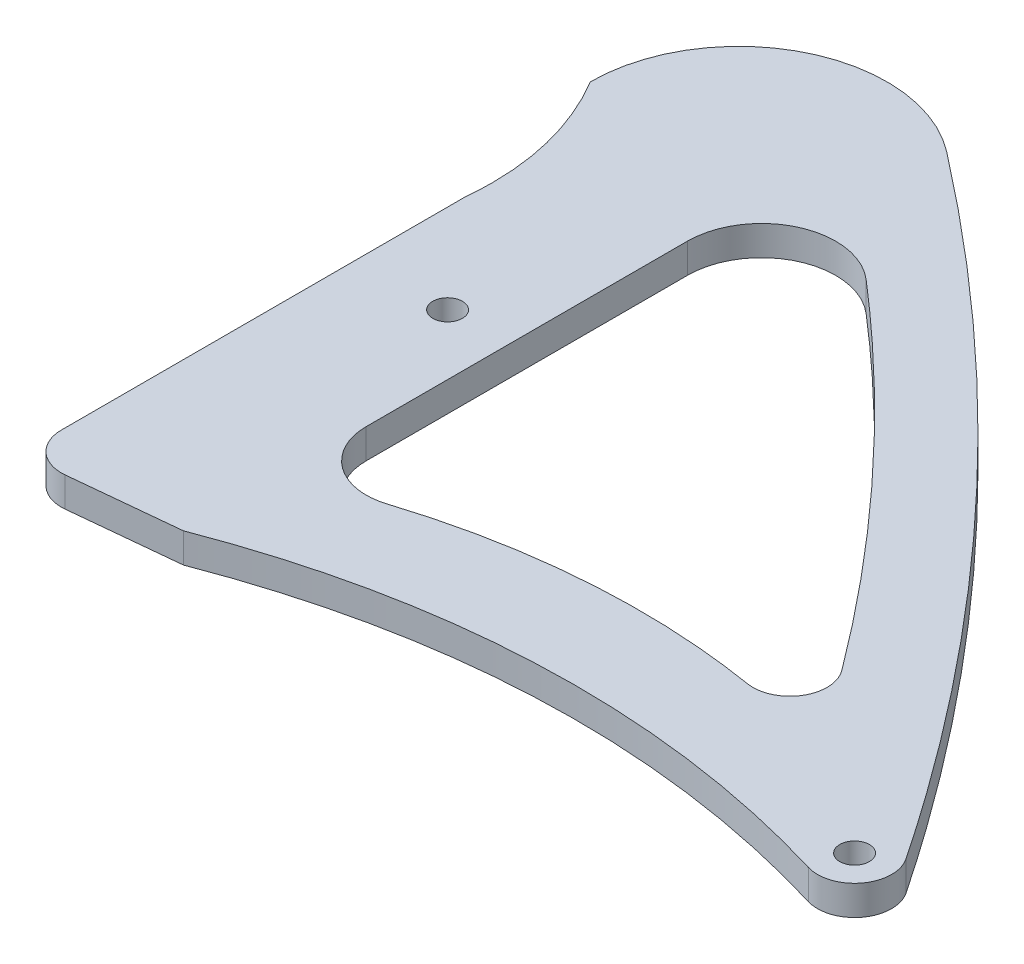
ISO-10303-21;
HEADER;
FILE_DESCRIPTION(('STEP AP214'),'2;1');
FILE_NAME('part.step','',(''),(''),'','','');
FILE_SCHEMA(('AUTOMOTIVE_DESIGN { 1 0 10303 214 1 1 1 1 }'));
ENDSEC;
DATA;
#1=APPLICATION_CONTEXT('core data for automotive mechanical design processes');
#2=APPLICATION_PROTOCOL_DEFINITION('international standard','automotive_design',2000,#1);
#3=PRODUCT_CONTEXT('',#1,'mechanical');
#4=PRODUCT('Part','Part','',(#3));
#5=PRODUCT_RELATED_PRODUCT_CATEGORY('part','',(#4));
#6=PRODUCT_DEFINITION_FORMATION('','',#4);
#7=PRODUCT_DEFINITION_CONTEXT('part definition',#1,'design');
#8=PRODUCT_DEFINITION('design','',#6,#7);
#9=PRODUCT_DEFINITION_SHAPE('','',#8);
#10=(LENGTH_UNIT() NAMED_UNIT(*) SI_UNIT(.MILLI.,.METRE.));
#11=(NAMED_UNIT(*) PLANE_ANGLE_UNIT() SI_UNIT($,.RADIAN.));
#12=(NAMED_UNIT(*) SI_UNIT($,.STERADIAN.) SOLID_ANGLE_UNIT());
#13=UNCERTAINTY_MEASURE_WITH_UNIT(LENGTH_MEASURE(1.E-05),#10,'distance_accuracy_value','');
#14=(GEOMETRIC_REPRESENTATION_CONTEXT(3) GLOBAL_UNCERTAINTY_ASSIGNED_CONTEXT((#13)) GLOBAL_UNIT_ASSIGNED_CONTEXT((#10,
#11,#12)) REPRESENTATION_CONTEXT('',''));
#15=CARTESIAN_POINT('',(0.,0.,0.));
#16=DIRECTION('',(0.,0.,1.));
#17=DIRECTION('',(1.,0.,0.));
#18=AXIS2_PLACEMENT_3D('',#15,#16,#17);
#19=CARTESIAN_POINT('',(0.0247524752475245,2.,0.247524752475246));
#20=DIRECTION('',(-0.0995037190209983,0.,-0.995037190209989));
#21=DIRECTION('',(-0.995037190209989,0.,0.0995037190209983));
#22=AXIS2_PLACEMENT_3D('',#19,#20,#21);
#23=PLANE('',#22);
#24=DIRECTION('',(0.995037190209989,0.,-0.0995037190209983));
#25=VECTOR('',#24,1.);
#26=CARTESIAN_POINT('',(0.0247524752475245,0.,0.247524752475246));
#27=LINE('',#26,#25);
#28=CARTESIAN_POINT('',(5.24875929755252,0.,-0.27487592975525));
#29=VERTEX_POINT('',#28);
#30=CARTESIAN_POINT('',(12.5,0.,-0.999999999999994));
#31=VERTEX_POINT('',#30);
#32=EDGE_CURVE('E217',#29,#31,#27,.T.);
#33=ORIENTED_EDGE('',*,*,#32,.T.);
#34=DIRECTION('',(0.,-1.,0.));
#35=VECTOR('',#34,1.);
#36=CARTESIAN_POINT('',(12.5,2.,-0.999999999999994));
#37=LINE('',#36,#35);
#38=CARTESIAN_POINT('',(12.5,2.,-0.999999999999994));
#39=VERTEX_POINT('',#38);
#40=EDGE_CURVE('E11',#39,#31,#37,.T.);
#41=ORIENTED_EDGE('',*,*,#40,.F.);
#42=DIRECTION('',(0.995037190209989,0.,-0.0995037190209983));
#43=VECTOR('',#42,1.);
#44=CARTESIAN_POINT('',(0.0247524752475245,2.,0.247524752475246));
#45=LINE('',#44,#43);
#46=CARTESIAN_POINT('',(5.24875929755252,2.,-0.27487592975525));
#47=VERTEX_POINT('',#46);
#48=EDGE_CURVE('E255',#47,#39,#45,.T.);
#49=ORIENTED_EDGE('',*,*,#48,.F.);
#50=DIRECTION('',(0.,-1.,0.));
#51=VECTOR('',#50,1.);
#52=CARTESIAN_POINT('',(5.24875929755252,2.,-0.27487592975525));
#53=LINE('',#52,#51);
#54=EDGE_CURVE('E216',#47,#29,#53,.T.);
#55=ORIENTED_EDGE('',*,*,#54,.T.);
#56=EDGE_LOOP('',(#33,#41,#49,#55));
#57=FACE_BOUND('',#56,.T.);
#58=ADVANCED_FACE('F34',(#57),#23,.F.);
#59=CARTESIAN_POINT('',(12.5,2.,-0.999999999999994));
#60=CARTESIAN_POINT('',(25.7162920583392,2.,-6.05677510446726));
#61=CARTESIAN_POINT('',(39.5099435997814,2.,-6.54560488054038));
#62=CARTESIAN_POINT('',(53.2206085148779,2.,-2.41364907753596));
#63=B_SPLINE_CURVE_WITH_KNOTS('',3,(#59,#60,#61,#62),.UNSPECIFIED.,.F.,.F.,(4,4),(0.,
0.858701093626255),.UNSPECIFIED.);
#64=DIRECTION('',(0.,-1.,0.));
#65=VECTOR('',#64,1.);
#66=SURFACE_OF_LINEAR_EXTRUSION('',#63,#65);
#67=CARTESIAN_POINT('',(12.5,0.,-0.999999999999994));
#68=CARTESIAN_POINT('',(25.7162920583392,0.,-6.05677510446726));
#69=CARTESIAN_POINT('',(39.5099435997814,0.,-6.54560488054038));
#70=CARTESIAN_POINT('',(53.2206085148779,0.,-2.41364907753596));
#71=B_SPLINE_CURVE_WITH_KNOTS('',3,(#67,#68,#69,#70),.UNSPECIFIED.,.F.,.F.,(4,4),(0.,
0.858701093626255),.UNSPECIFIED.);
#72=CARTESIAN_POINT('',(53.2206085148779,0.,-2.41364907753596));
#73=VERTEX_POINT('',#72);
#74=EDGE_CURVE('E220',#31,#73,#71,.T.);
#75=ORIENTED_EDGE('',*,*,#74,.T.);
#76=DIRECTION('',(0.,-1.,0.));
#77=VECTOR('',#76,1.);
#78=CARTESIAN_POINT('',(53.2206085148779,2.,-2.41364907753596));
#79=LINE('',#78,#77);
#80=CARTESIAN_POINT('',(53.2206085148779,2.,-2.41364907753596));
#81=VERTEX_POINT('',#80);
#82=EDGE_CURVE('E41',#81,#73,#79,.T.);
#83=ORIENTED_EDGE('',*,*,#82,.F.);
#84=EDGE_CURVE('E289',#39,#81,#63,.T.);
#85=ORIENTED_EDGE('',*,*,#84,.F.);
#86=ORIENTED_EDGE('',*,*,#40,.T.);
#87=EDGE_LOOP('',(#75,#83,#85,#86));
#88=FACE_BOUND('',#87,.T.);
#89=ADVANCED_FACE('F301',(#88),#66,.F.);
#90=CARTESIAN_POINT('',(53.9419818420209,2.,-4.80731165252154));
#91=DIRECTION('',(0.,-1.,0.));
#92=DIRECTION('',(0.,0.,-1.));
#93=AXIS2_PLACEMENT_3D('',#90,#91,#92);
#94=CYLINDRICAL_SURFACE('',#93,2.5);
#95=CARTESIAN_POINT('',(53.9419818420209,0.,-4.80731165252154));
#96=DIRECTION('',(0.,1.,0.));
#97=DIRECTION('',(0.,0.,1.));
#98=AXIS2_PLACEMENT_3D('',#95,#96,#97);
#99=CIRCLE('',#98,2.5);
#100=CARTESIAN_POINT('',(56.0179202051217,0.,-6.20032274817246));
#101=VERTEX_POINT('',#100);
#102=EDGE_CURVE('E225',#73,#101,#99,.T.);
#103=ORIENTED_EDGE('',*,*,#102,.T.);
#104=DIRECTION('',(0.,-1.,0.));
#105=VECTOR('',#104,1.);
#106=CARTESIAN_POINT('',(56.0179202051217,2.,-6.20032274817246));
#107=LINE('',#106,#105);
#108=CARTESIAN_POINT('',(56.0179202051217,2.,-6.20032274817246));
#109=VERTEX_POINT('',#108);
#110=EDGE_CURVE('E266',#109,#101,#107,.T.);
#111=ORIENTED_EDGE('',*,*,#110,.F.);
#112=CARTESIAN_POINT('',(53.9419818420209,2.,-4.80731165252154));
#113=DIRECTION('',(0.,1.,0.));
#114=DIRECTION('',(0.,0.,1.));
#115=AXIS2_PLACEMENT_3D('',#112,#113,#114);
#116=CIRCLE('',#115,2.5);
#117=EDGE_CURVE('E274',#81,#109,#116,.T.);
#118=ORIENTED_EDGE('',*,*,#117,.F.);
#119=ORIENTED_EDGE('',*,*,#82,.T.);
#120=EDGE_LOOP('',(#103,#111,#118,#119));
#121=FACE_BOUND('',#120,.T.);
#122=ADVANCED_FACE('F272',(#121),#94,.T.);
#123=CARTESIAN_POINT('',(16.1111968598617,2.,-48.8540753502753));
#124=CARTESIAN_POINT('',(22.252071456647,2.,-44.1129152479801));
#125=CARTESIAN_POINT('',(36.9405612707366,2.,-31.197181318025));
#126=CARTESIAN_POINT('',(49.4059047823639,2.,-16.0538957142247));
#127=CARTESIAN_POINT('',(56.0179202051217,2.,-6.20032274817246));
#128=B_SPLINE_CURVE_WITH_KNOTS('',3,(#123,#124,#125,#126,#127),.UNSPECIFIED.,.F.,.F.,(4,1,4),
(0.227142679246246,0.499193546723256,0.914214995518048),.UNSPECIFIED.);
#129=DIRECTION('',(0.,-1.,0.));
#130=VECTOR('',#129,1.);
#131=SURFACE_OF_LINEAR_EXTRUSION('',#128,#130);
#132=CARTESIAN_POINT('',(16.1111968598617,0.,-48.8540753502753));
#133=CARTESIAN_POINT('',(22.252071456647,0.,-44.1129152479801));
#134=CARTESIAN_POINT('',(36.9405612707366,0.,-31.197181318025));
#135=CARTESIAN_POINT('',(49.4059047823639,0.,-16.0538957142247));
#136=CARTESIAN_POINT('',(56.0179202051217,0.,-6.20032274817246));
#137=B_SPLINE_CURVE_WITH_KNOTS('',3,(#132,#133,#134,#135,#136),.UNSPECIFIED.,.F.,.F.,(4,1,4),
(0.227142679246246,0.499193546723256,0.914214995518048),.UNSPECIFIED.);
#138=CARTESIAN_POINT('',(16.1111968598617,0.,-48.8540753502753));
#139=VERTEX_POINT('',#138);
#140=EDGE_CURVE('E231',#139,#101,#137,.T.);
#141=ORIENTED_EDGE('',*,*,#140,.F.);
#142=DIRECTION('',(0.,-1.,0.));
#143=VECTOR('',#142,1.);
#144=CARTESIAN_POINT('',(16.1111968598617,2.,-48.8540753502753));
#145=LINE('',#144,#143);
#146=CARTESIAN_POINT('',(16.1111968598617,2.,-48.8540753502753));
#147=VERTEX_POINT('',#146);
#148=EDGE_CURVE('E264',#147,#139,#145,.T.);
#149=ORIENTED_EDGE('',*,*,#148,.F.);
#150=EDGE_CURVE('E285',#147,#109,#128,.T.);
#151=ORIENTED_EDGE('',*,*,#150,.T.);
#152=ORIENTED_EDGE('',*,*,#110,.T.);
#153=EDGE_LOOP('',(#141,#149,#151,#152));
#154=FACE_BOUND('',#153,.T.);
#155=ADVANCED_FACE('F282',(#154),#131,.T.);
#156=CARTESIAN_POINT('',(10.,2.,-40.9386933039041));
#157=DIRECTION('',(0.,-1.,0.));
#158=DIRECTION('',(0.,0.,-1.));
#159=AXIS2_PLACEMENT_3D('',#156,#157,#158);
#160=CYLINDRICAL_SURFACE('',#159,10.);
#161=CARTESIAN_POINT('',(10.,0.,-40.9386933039041));
#162=DIRECTION('',(0.,1.,0.));
#163=DIRECTION('',(0.,0.,1.));
#164=AXIS2_PLACEMENT_3D('',#161,#162,#163);
#165=CIRCLE('',#164,10.);
#166=CARTESIAN_POINT('',(0.,0.,-40.9386933039041));
#167=VERTEX_POINT('',#166);
#168=EDGE_CURVE('E236',#167,#139,#165,.F.);
#169=ORIENTED_EDGE('',*,*,#168,.F.);
#170=DIRECTION('',(0.,-1.,0.));
#171=VECTOR('',#170,1.);
#172=CARTESIAN_POINT('',(0.,2.,-40.9386933039041));
#173=LINE('',#172,#171);
#174=CARTESIAN_POINT('',(0.,2.,-40.9386933039041));
#175=VERTEX_POINT('',#174);
#176=EDGE_CURVE('E262',#175,#167,#173,.T.);
#177=ORIENTED_EDGE('',*,*,#176,.F.);
#178=CARTESIAN_POINT('',(10.,2.,-40.9386933039041));
#179=DIRECTION('',(0.,1.,0.));
#180=DIRECTION('',(0.,0.,1.));
#181=AXIS2_PLACEMENT_3D('',#178,#179,#180);
#182=CIRCLE('',#181,10.);
#183=EDGE_CURVE('E207',#175,#147,#182,.F.);
#184=ORIENTED_EDGE('',*,*,#183,.T.);
#185=ORIENTED_EDGE('',*,*,#148,.T.);
#186=EDGE_LOOP('',(#169,#177,#184,#185));
#187=FACE_BOUND('',#186,.T.);
#188=ADVANCED_FACE('F197',(#187),#160,.T.);
#189=CARTESIAN_POINT('',(0.,2.,-40.9386933039041));
#190=CARTESIAN_POINT('',(3.06558529567129,2.,-35.7676282162134));
#191=CARTESIAN_POINT('',(2.5,2.,-30.));
#192=B_SPLINE_CURVE_WITH_KNOTS('',2,(#189,#190,#191),.UNSPECIFIED.,.F.,.F.,(3,3),(0.,1.),.UNSPECIFIED.);
#193=DIRECTION('',(0.,-1.,0.));
#194=VECTOR('',#193,1.);
#195=SURFACE_OF_LINEAR_EXTRUSION('',#192,#194);
#196=CARTESIAN_POINT('',(0.,0.,-40.9386933039041));
#197=CARTESIAN_POINT('',(3.06558529567129,0.,-35.7676282162134));
#198=CARTESIAN_POINT('',(2.5,0.,-30.));
#199=B_SPLINE_CURVE_WITH_KNOTS('',2,(#196,#197,#198),.UNSPECIFIED.,.F.,.F.,(3,3),(0.,1.),.UNSPECIFIED.);
#200=CARTESIAN_POINT('',(2.5,0.,-30.));
#201=VERTEX_POINT('',#200);
#202=EDGE_CURVE('E242',#167,#201,#199,.T.);
#203=ORIENTED_EDGE('',*,*,#202,.T.);
#204=DIRECTION('',(0.,-1.,0.));
#205=VECTOR('',#204,1.);
#206=CARTESIAN_POINT('',(2.5,2.,-30.));
#207=LINE('',#206,#205);
#208=CARTESIAN_POINT('',(2.5,2.,-30.));
#209=VERTEX_POINT('',#208);
#210=EDGE_CURVE('E259',#209,#201,#207,.T.);
#211=ORIENTED_EDGE('',*,*,#210,.F.);
#212=EDGE_CURVE('E200',#175,#209,#192,.T.);
#213=ORIENTED_EDGE('',*,*,#212,.F.);
#214=ORIENTED_EDGE('',*,*,#176,.T.);
#215=EDGE_LOOP('',(#203,#211,#213,#214));
#216=FACE_BOUND('',#215,.T.);
#217=ADVANCED_FACE('F192',(#216),#195,.F.);
#218=CARTESIAN_POINT('',(2.5,2.,0.));
#219=DIRECTION('',(1.,0.,0.));
#220=DIRECTION('',(0.,0.,-1.));
#221=AXIS2_PLACEMENT_3D('',#218,#219,#220);
#222=PLANE('',#221);
#223=DIRECTION('',(0.,0.,1.));
#224=VECTOR('',#223,1.);
#225=CARTESIAN_POINT('',(2.5,0.,0.));
#226=LINE('',#225,#224);
#227=CARTESIAN_POINT('',(2.5,0.,-2.76246890528024));
#228=VERTEX_POINT('',#227);
#229=EDGE_CURVE('E246',#201,#228,#226,.T.);
#230=ORIENTED_EDGE('',*,*,#229,.T.);
#231=DIRECTION('',(0.,-1.,0.));
#232=VECTOR('',#231,1.);
#233=CARTESIAN_POINT('',(2.5,2.,-2.76246890528024));
#234=LINE('',#233,#232);
#235=CARTESIAN_POINT('',(2.5,2.,-2.76246890528024));
#236=VERTEX_POINT('',#235);
#237=EDGE_CURVE('E257',#236,#228,#234,.T.);
#238=ORIENTED_EDGE('',*,*,#237,.F.);
#239=DIRECTION('',(0.,0.,1.));
#240=VECTOR('',#239,1.);
#241=CARTESIAN_POINT('',(2.5,2.,0.));
#242=LINE('',#241,#240);
#243=EDGE_CURVE('E206',#209,#236,#242,.T.);
#244=ORIENTED_EDGE('',*,*,#243,.F.);
#245=ORIENTED_EDGE('',*,*,#210,.T.);
#246=EDGE_LOOP('',(#230,#238,#244,#245));
#247=FACE_BOUND('',#246,.T.);
#248=ADVANCED_FACE('F188',(#247),#222,.F.);
#249=CARTESIAN_POINT('',(5.,2.,-2.76246890528022));
#250=DIRECTION('',(0.,-1.,0.));
#251=DIRECTION('',(0.,0.,-1.));
#252=AXIS2_PLACEMENT_3D('',#249,#250,#251);
#253=CYLINDRICAL_SURFACE('',#252,2.5);
#254=CARTESIAN_POINT('',(5.,0.,-2.76246890528022));
#255=DIRECTION('',(0.,1.,0.));
#256=DIRECTION('',(0.,0.,1.));
#257=AXIS2_PLACEMENT_3D('',#254,#255,#256);
#258=CIRCLE('',#257,2.5);
#259=EDGE_CURVE('E252',#29,#228,#258,.F.);
#260=ORIENTED_EDGE('',*,*,#259,.F.);
#261=ORIENTED_EDGE('',*,*,#54,.F.);
#262=CARTESIAN_POINT('',(5.,2.,-2.76246890528022));
#263=DIRECTION('',(0.,1.,0.));
#264=DIRECTION('',(0.,0.,1.));
#265=AXIS2_PLACEMENT_3D('',#262,#263,#264);
#266=CIRCLE('',#265,2.5);
#267=EDGE_CURVE('E213',#47,#236,#266,.F.);
#268=ORIENTED_EDGE('',*,*,#267,.T.);
#269=ORIENTED_EDGE('',*,*,#237,.T.);
#270=EDGE_LOOP('',(#260,#261,#268,#269));
#271=FACE_BOUND('',#270,.T.);
#272=ADVANCED_FACE('F182',(#271),#253,.T.);
#273=CARTESIAN_POINT('',(0.,2.,0.));
#274=DIRECTION('',(0.,1.,0.));
#275=DIRECTION('',(0.,0.,1.));
#276=AXIS2_PLACEMENT_3D('',#273,#274,#275);
#277=PLANE('',#276);
#278=CARTESIAN_POINT('',(17.7889656317403,2.,-9.430774412466));
#279=CARTESIAN_POINT('',(22.2505105706232,2.,-10.8509860192013));
#280=CARTESIAN_POINT('',(29.8378088415706,2.,-12.1102882079974));
#281=CARTESIAN_POINT('',(37.4471713302521,2.,-11.5745321318942));
#282=CARTESIAN_POINT('',(40.437472291991,2.,-11.0850304571488));
#283=B_SPLINE_CURVE_WITH_KNOTS('',3,(#278,#279,#280,#281,#282),.UNSPECIFIED.,.F.,.F.,(4,1,4),
(0.180465318836829,0.581460174723462,0.84191175563105),.UNSPECIFIED.);
#284=CARTESIAN_POINT('',(17.7889656317403,2.,-9.43077441246601));
#285=VERTEX_POINT('',#284);
#286=CARTESIAN_POINT('',(40.437472291991,2.,-11.0850304571488));
#287=VERTEX_POINT('',#286);
#288=EDGE_CURVE('E48',#285,#287,#283,.T.);
#289=ORIENTED_EDGE('',*,*,#288,.F.);
#290=CARTESIAN_POINT('',(16.575662953929,2.,-13.2423222098858));
#291=DIRECTION('',(0.,1.,0.));
#292=DIRECTION('',(0.,0.,1.));
#293=AXIS2_PLACEMENT_3D('',#290,#291,#292);
#294=CIRCLE('',#293,3.99999999999999);
#295=CARTESIAN_POINT('',(12.575662953929,2.,-13.2423222098858));
#296=VERTEX_POINT('',#295);
#297=EDGE_CURVE('E153',#296,#285,#294,.T.);
#298=ORIENTED_EDGE('',*,*,#297,.F.);
#299=DIRECTION('',(0.,0.,1.));
#300=VECTOR('',#299,1.);
#301=CARTESIAN_POINT('',(12.575662953929,2.,-34.9024948104022));
#302=LINE('',#301,#300);
#303=CARTESIAN_POINT('',(12.575662953929,2.,-34.9024948104022));
#304=VERTEX_POINT('',#303);
#305=EDGE_CURVE('E156',#304,#296,#302,.T.);
#306=ORIENTED_EDGE('',*,*,#305,.F.);
#307=CARTESIAN_POINT('',(17.575662953929,2.,-34.9024948104022));
#308=DIRECTION('',(0.,1.,0.));
#309=DIRECTION('',(0.,0.,-1.));
#310=AXIS2_PLACEMENT_3D('',#307,#308,#309);
#311=CIRCLE('',#310,5.);
#312=CARTESIAN_POINT('',(20.8408430332192,2.,-38.6891290744693));
#313=VERTEX_POINT('',#312);
#314=EDGE_CURVE('E334',#313,#304,#311,.T.);
#315=ORIENTED_EDGE('',*,*,#314,.F.);
#316=CARTESIAN_POINT('',(42.8464709986048,2.,-15.0453249191727));
#317=CARTESIAN_POINT('',(39.711612856588,2.,-19.25513938861));
#318=CARTESIAN_POINT('',(32.8272217276598,2.,-27.5466683829167));
#319=CARTESIAN_POINT('',(25.0582583264675,2.,-35.0524904552386));
#320=CARTESIAN_POINT('',(20.8408430332192,2.,-38.6891290744693));
#321=B_SPLINE_CURVE_WITH_KNOTS('',3,(#316,#317,#318,#319,#320),.UNSPECIFIED.,.F.,.F.,(4,1,4),
(0.213220669584268,0.530338364188382,0.86745728055952),.UNSPECIFIED.);
#322=CARTESIAN_POINT('',(42.8464709986048,2.,-15.0453249191727));
#323=VERTEX_POINT('',#322);
#324=EDGE_CURVE('E337',#323,#313,#321,.T.);
#325=ORIENTED_EDGE('',*,*,#324,.F.);
#326=CARTESIAN_POINT('',(40.8413381068417,2.,-13.5521932818515));
#327=DIRECTION('',(0.,1.,0.));
#328=DIRECTION('',(0.,0.,1.));
#329=AXIS2_PLACEMENT_3D('',#326,#327,#328);
#330=CIRCLE('',#329,2.5);
#331=EDGE_CURVE('E342',#287,#323,#330,.T.);
#332=ORIENTED_EDGE('',*,*,#331,.F.);
#333=EDGE_LOOP('',(#289,#298,#306,#315,#325,#332));
#334=FACE_BOUND('',#333,.T.);
#335=CARTESIAN_POINT('',(8.5,2.,-22.8073116525215));
#336=DIRECTION('',(0.,1.,0.));
#337=DIRECTION('',(0.,0.,1.));
#338=AXIS2_PLACEMENT_3D('',#335,#336,#337);
#339=CIRCLE('',#338,1.);
#340=CARTESIAN_POINT('',(8.5,2.,-21.8073116525215));
#341=VERTEX_POINT('',#340);
#342=EDGE_CURVE('E318',#341,#341,#339,.T.);
#343=ORIENTED_EDGE('',*,*,#342,.F.);
#344=EDGE_LOOP('',(#343));
#345=FACE_BOUND('',#344,.T.);
#346=CARTESIAN_POINT('',(53.9419818420209,2.,-4.80731165252154));
#347=DIRECTION('',(0.,1.,0.));
#348=DIRECTION('',(0.,0.,1.));
#349=AXIS2_PLACEMENT_3D('',#346,#347,#348);
#350=CIRCLE('',#349,0.999999999999998);
#351=CARTESIAN_POINT('',(53.9419818420209,2.,-3.80731165252155));
#352=VERTEX_POINT('',#351);
#353=EDGE_CURVE('E312',#352,#352,#350,.T.);
#354=ORIENTED_EDGE('',*,*,#353,.F.);
#355=EDGE_LOOP('',(#354));
#356=FACE_BOUND('',#355,.T.);
#357=ORIENTED_EDGE('',*,*,#48,.T.);
#358=ORIENTED_EDGE('',*,*,#84,.T.);
#359=ORIENTED_EDGE('',*,*,#117,.T.);
#360=ORIENTED_EDGE('',*,*,#150,.F.);
#361=ORIENTED_EDGE('',*,*,#183,.F.);
#362=ORIENTED_EDGE('',*,*,#212,.T.);
#363=ORIENTED_EDGE('',*,*,#243,.T.);
#364=ORIENTED_EDGE('',*,*,#267,.F.);
#365=EDGE_LOOP('',(#357,#358,#359,#360,#361,#362,#363,#364));
#366=FACE_BOUND('',#365,.T.);
#367=ADVANCED_FACE('F179',(#334,#345,#356,#366),#277,.T.);
#368=CARTESIAN_POINT('',(0.,0.,0.));
#369=DIRECTION('',(0.,1.,0.));
#370=DIRECTION('',(0.,0.,1.));
#371=AXIS2_PLACEMENT_3D('',#368,#369,#370);
#372=PLANE('',#371);
#373=CARTESIAN_POINT('',(16.575662953929,0.,-13.2423222098858));
#374=DIRECTION('',(0.,1.,0.));
#375=DIRECTION('',(0.,0.,1.));
#376=AXIS2_PLACEMENT_3D('',#373,#374,#375);
#377=CIRCLE('',#376,3.99999999999999);
#378=CARTESIAN_POINT('',(12.575662953929,0.,-13.2423222098858));
#379=VERTEX_POINT('',#378);
#380=CARTESIAN_POINT('',(17.7889656317403,0.,-9.43077441246601));
#381=VERTEX_POINT('',#380);
#382=EDGE_CURVE('E142',#379,#381,#377,.T.);
#383=ORIENTED_EDGE('',*,*,#382,.T.);
#384=CARTESIAN_POINT('',(17.7889656317403,0.,-9.430774412466));
#385=CARTESIAN_POINT('',(22.2505105706232,0.,-10.8509860192013));
#386=CARTESIAN_POINT('',(29.8378088415706,0.,-12.1102882079974));
#387=CARTESIAN_POINT('',(37.4471713302521,0.,-11.5745321318942));
#388=CARTESIAN_POINT('',(40.437472291991,0.,-11.0850304571488));
#389=B_SPLINE_CURVE_WITH_KNOTS('',3,(#384,#385,#386,#387,#388),.UNSPECIFIED.,.F.,.F.,(4,1,4),
(0.180465318836829,0.581460174723462,0.84191175563105),.UNSPECIFIED.);
#390=CARTESIAN_POINT('',(40.437472291991,0.,-11.0850304571488));
#391=VERTEX_POINT('',#390);
#392=EDGE_CURVE('E136',#381,#391,#389,.T.);
#393=ORIENTED_EDGE('',*,*,#392,.T.);
#394=CARTESIAN_POINT('',(40.8413381068417,0.,-13.5521932818515));
#395=DIRECTION('',(0.,1.,0.));
#396=DIRECTION('',(0.,0.,1.));
#397=AXIS2_PLACEMENT_3D('',#394,#395,#396);
#398=CIRCLE('',#397,2.5);
#399=CARTESIAN_POINT('',(42.8464709986048,0.,-15.0453249191727));
#400=VERTEX_POINT('',#399);
#401=EDGE_CURVE('E145',#391,#400,#398,.T.);
#402=ORIENTED_EDGE('',*,*,#401,.T.);
#403=CARTESIAN_POINT('',(42.8464709986048,0.,-15.0453249191727));
#404=CARTESIAN_POINT('',(39.711612856588,0.,-19.25513938861));
#405=CARTESIAN_POINT('',(32.8272217276598,0.,-27.5466683829167));
#406=CARTESIAN_POINT('',(25.0582583264675,0.,-35.0524904552386));
#407=CARTESIAN_POINT('',(20.8408430332192,0.,-38.6891290744693));
#408=B_SPLINE_CURVE_WITH_KNOTS('',3,(#403,#404,#405,#406,#407),.UNSPECIFIED.,.F.,.F.,(4,1,4),
(0.213220669584268,0.530338364188382,0.86745728055952),.UNSPECIFIED.);
#409=CARTESIAN_POINT('',(20.8408430332192,0.,-38.6891290744693));
#410=VERTEX_POINT('',#409);
#411=EDGE_CURVE('E56',#400,#410,#408,.T.);
#412=ORIENTED_EDGE('',*,*,#411,.T.);
#413=CARTESIAN_POINT('',(17.575662953929,0.,-34.9024948104022));
#414=DIRECTION('',(0.,1.,0.));
#415=DIRECTION('',(0.,0.,-1.));
#416=AXIS2_PLACEMENT_3D('',#413,#414,#415);
#417=CIRCLE('',#416,5.);
#418=CARTESIAN_POINT('',(12.575662953929,0.,-34.9024948104022));
#419=VERTEX_POINT('',#418);
#420=EDGE_CURVE('E356',#410,#419,#417,.T.);
#421=ORIENTED_EDGE('',*,*,#420,.T.);
#422=DIRECTION('',(0.,0.,1.));
#423=VECTOR('',#422,1.);
#424=CARTESIAN_POINT('',(12.575662953929,0.,-34.9024948104022));
#425=LINE('',#424,#423);
#426=EDGE_CURVE('E354',#419,#379,#425,.T.);
#427=ORIENTED_EDGE('',*,*,#426,.T.);
#428=EDGE_LOOP('',(#383,#393,#402,#412,#421,#427));
#429=FACE_BOUND('',#428,.T.);
#430=CARTESIAN_POINT('',(8.5,0.,-22.8073116525215));
#431=DIRECTION('',(0.,1.,0.));
#432=DIRECTION('',(0.,0.,1.));
#433=AXIS2_PLACEMENT_3D('',#430,#431,#432);
#434=CIRCLE('',#433,1.);
#435=CARTESIAN_POINT('',(8.5,0.,-21.8073116525215));
#436=VERTEX_POINT('',#435);
#437=EDGE_CURVE('E315',#436,#436,#434,.T.);
#438=ORIENTED_EDGE('',*,*,#437,.T.);
#439=EDGE_LOOP('',(#438));
#440=FACE_BOUND('',#439,.T.);
#441=CARTESIAN_POINT('',(53.9419818420209,0.,-4.80731165252154));
#442=DIRECTION('',(0.,1.,0.));
#443=DIRECTION('',(0.,0.,1.));
#444=AXIS2_PLACEMENT_3D('',#441,#442,#443);
#445=CIRCLE('',#444,0.999999999999998);
#446=CARTESIAN_POINT('',(53.9419818420209,0.,-3.80731165252155));
#447=VERTEX_POINT('',#446);
#448=EDGE_CURVE('E221',#447,#447,#445,.T.);
#449=ORIENTED_EDGE('',*,*,#448,.T.);
#450=EDGE_LOOP('',(#449));
#451=FACE_BOUND('',#450,.T.);
#452=ORIENTED_EDGE('',*,*,#32,.F.);
#453=ORIENTED_EDGE('',*,*,#259,.T.);
#454=ORIENTED_EDGE('',*,*,#229,.F.);
#455=ORIENTED_EDGE('',*,*,#202,.F.);
#456=ORIENTED_EDGE('',*,*,#168,.T.);
#457=ORIENTED_EDGE('',*,*,#140,.T.);
#458=ORIENTED_EDGE('',*,*,#102,.F.);
#459=ORIENTED_EDGE('',*,*,#74,.F.);
#460=EDGE_LOOP('',(#452,#453,#454,#455,#456,#457,#458,#459));
#461=FACE_BOUND('',#460,.T.);
#462=ADVANCED_FACE('F149',(#429,#440,#451,#461),#372,.F.);
#463=CARTESIAN_POINT('',(53.9419818420209,0.,-4.80731165252154));
#464=DIRECTION('',(0.,1.,0.));
#465=DIRECTION('',(0.,0.,1.));
#466=AXIS2_PLACEMENT_3D('',#463,#464,#465);
#467=CYLINDRICAL_SURFACE('',#466,0.999999999999998);
#468=ORIENTED_EDGE('',*,*,#448,.F.);
#469=EDGE_LOOP('',(#468));
#470=FACE_BOUND('',#469,.T.);
#471=ORIENTED_EDGE('',*,*,#353,.T.);
#472=EDGE_LOOP('',(#471));
#473=FACE_BOUND('',#472,.T.);
#474=ADVANCED_FACE('F174',(#470,#473),#467,.F.);
#475=CARTESIAN_POINT('',(8.5,0.,-22.8073116525215));
#476=DIRECTION('',(0.,1.,0.));
#477=DIRECTION('',(0.,0.,1.));
#478=AXIS2_PLACEMENT_3D('',#475,#476,#477);
#479=CYLINDRICAL_SURFACE('',#478,1.);
#480=ORIENTED_EDGE('',*,*,#437,.F.);
#481=EDGE_LOOP('',(#480));
#482=FACE_BOUND('',#481,.T.);
#483=ORIENTED_EDGE('',*,*,#342,.T.);
#484=EDGE_LOOP('',(#483));
#485=FACE_BOUND('',#484,.T.);
#486=ADVANCED_FACE('F170',(#482,#485),#479,.F.);
#487=DIRECTION('',(0.,1.,0.));
#488=VECTOR('',#487,1.);
#489=SURFACE_OF_LINEAR_EXTRUSION('',#389,#488);
#490=ORIENTED_EDGE('',*,*,#288,.T.);
#491=DIRECTION('',(0.,1.,0.));
#492=VECTOR('',#491,1.);
#493=CARTESIAN_POINT('',(40.437472291991,0.,-11.0850304571488));
#494=LINE('',#493,#492);
#495=EDGE_CURVE('E132',#391,#287,#494,.T.);
#496=ORIENTED_EDGE('',*,*,#495,.F.);
#497=ORIENTED_EDGE('',*,*,#392,.F.);
#498=DIRECTION('',(0.,1.,0.));
#499=VECTOR('',#498,1.);
#500=CARTESIAN_POINT('',(17.7889656317403,0.,-9.43077441246601));
#501=LINE('',#500,#499);
#502=EDGE_CURVE('E321',#381,#285,#501,.T.);
#503=ORIENTED_EDGE('',*,*,#502,.T.);
#504=EDGE_LOOP('',(#490,#496,#497,#503));
#505=FACE_BOUND('',#504,.T.);
#506=ADVANCED_FACE('F134',(#505),#489,.F.);
#507=CARTESIAN_POINT('',(16.575662953929,0.,-13.2423222098858));
#508=DIRECTION('',(0.,1.,0.));
#509=DIRECTION('',(0.,0.,1.));
#510=AXIS2_PLACEMENT_3D('',#507,#508,#509);
#511=CYLINDRICAL_SURFACE('',#510,3.99999999999999);
#512=ORIENTED_EDGE('',*,*,#297,.T.);
#513=ORIENTED_EDGE('',*,*,#502,.F.);
#514=ORIENTED_EDGE('',*,*,#382,.F.);
#515=DIRECTION('',(0.,1.,0.));
#516=VECTOR('',#515,1.);
#517=CARTESIAN_POINT('',(12.575662953929,0.,-13.2423222098858));
#518=LINE('',#517,#516);
#519=EDGE_CURVE('E329',#379,#296,#518,.T.);
#520=ORIENTED_EDGE('',*,*,#519,.T.);
#521=EDGE_LOOP('',(#512,#513,#514,#520));
#522=FACE_BOUND('',#521,.T.);
#523=ADVANCED_FACE('F169',(#522),#511,.F.);
#524=CARTESIAN_POINT('',(12.575662953929,0.,-34.9024948104022));
#525=DIRECTION('',(-1.,0.,0.));
#526=DIRECTION('',(0.,0.,1.));
#527=AXIS2_PLACEMENT_3D('',#524,#525,#526);
#528=PLANE('',#527);
#529=ORIENTED_EDGE('',*,*,#305,.T.);
#530=ORIENTED_EDGE('',*,*,#519,.F.);
#531=ORIENTED_EDGE('',*,*,#426,.F.);
#532=DIRECTION('',(0.,1.,0.));
#533=VECTOR('',#532,1.);
#534=CARTESIAN_POINT('',(12.575662953929,0.,-34.9024948104022));
#535=LINE('',#534,#533);
#536=EDGE_CURVE('E327',#419,#304,#535,.T.);
#537=ORIENTED_EDGE('',*,*,#536,.T.);
#538=EDGE_LOOP('',(#529,#530,#531,#537));
#539=FACE_BOUND('',#538,.T.);
#540=ADVANCED_FACE('F370',(#539),#528,.F.);
#541=CARTESIAN_POINT('',(17.575662953929,0.,-34.9024948104022));
#542=DIRECTION('',(0.,1.,0.));
#543=DIRECTION('',(0.,0.,1.));
#544=AXIS2_PLACEMENT_3D('',#541,#542,#543);
#545=CYLINDRICAL_SURFACE('',#544,5.);
#546=ORIENTED_EDGE('',*,*,#314,.T.);
#547=ORIENTED_EDGE('',*,*,#536,.F.);
#548=ORIENTED_EDGE('',*,*,#420,.F.);
#549=DIRECTION('',(0.,1.,0.));
#550=VECTOR('',#549,1.);
#551=CARTESIAN_POINT('',(20.8408430332192,0.,-38.6891290744693));
#552=LINE('',#551,#550);
#553=EDGE_CURVE('E325',#410,#313,#552,.T.);
#554=ORIENTED_EDGE('',*,*,#553,.T.);
#555=EDGE_LOOP('',(#546,#547,#548,#554));
#556=FACE_BOUND('',#555,.T.);
#557=ADVANCED_FACE('F367',(#556),#545,.F.);
#558=DIRECTION('',(0.,1.,0.));
#559=VECTOR('',#558,1.);
#560=SURFACE_OF_LINEAR_EXTRUSION('',#408,#559);
#561=ORIENTED_EDGE('',*,*,#324,.T.);
#562=ORIENTED_EDGE('',*,*,#553,.F.);
#563=ORIENTED_EDGE('',*,*,#411,.F.);
#564=DIRECTION('',(0.,1.,0.));
#565=VECTOR('',#564,1.);
#566=CARTESIAN_POINT('',(42.8464709986048,0.,-15.0453249191727));
#567=LINE('',#566,#565);
#568=EDGE_CURVE('E141',#400,#323,#567,.T.);
#569=ORIENTED_EDGE('',*,*,#568,.T.);
#570=EDGE_LOOP('',(#561,#562,#563,#569));
#571=FACE_BOUND('',#570,.T.);
#572=ADVANCED_FACE('F364',(#571),#560,.F.);
#573=CARTESIAN_POINT('',(40.8413381068417,0.,-13.5521932818515));
#574=DIRECTION('',(0.,1.,0.));
#575=DIRECTION('',(0.,0.,1.));
#576=AXIS2_PLACEMENT_3D('',#573,#574,#575);
#577=CYLINDRICAL_SURFACE('',#576,2.5);
#578=ORIENTED_EDGE('',*,*,#331,.T.);
#579=ORIENTED_EDGE('',*,*,#568,.F.);
#580=ORIENTED_EDGE('',*,*,#401,.F.);
#581=ORIENTED_EDGE('',*,*,#495,.T.);
#582=EDGE_LOOP('',(#578,#579,#580,#581));
#583=FACE_BOUND('',#582,.T.);
#584=ADVANCED_FACE('F146',(#583),#577,.F.);
#585=CLOSED_SHELL('',(#58,#89,#122,#155,#188,#217,#248,#272,#367,#462,#474,#486,#506,#523,#540,
#557,#572,#584));
#586=MANIFOLD_SOLID_BREP('B2',#585);
#587=ADVANCED_BREP_SHAPE_REPRESENTATION('',(#18,#586),#14);
#588=SHAPE_DEFINITION_REPRESENTATION(#9,#587);
ENDSEC;
END-ISO-10303-21;
